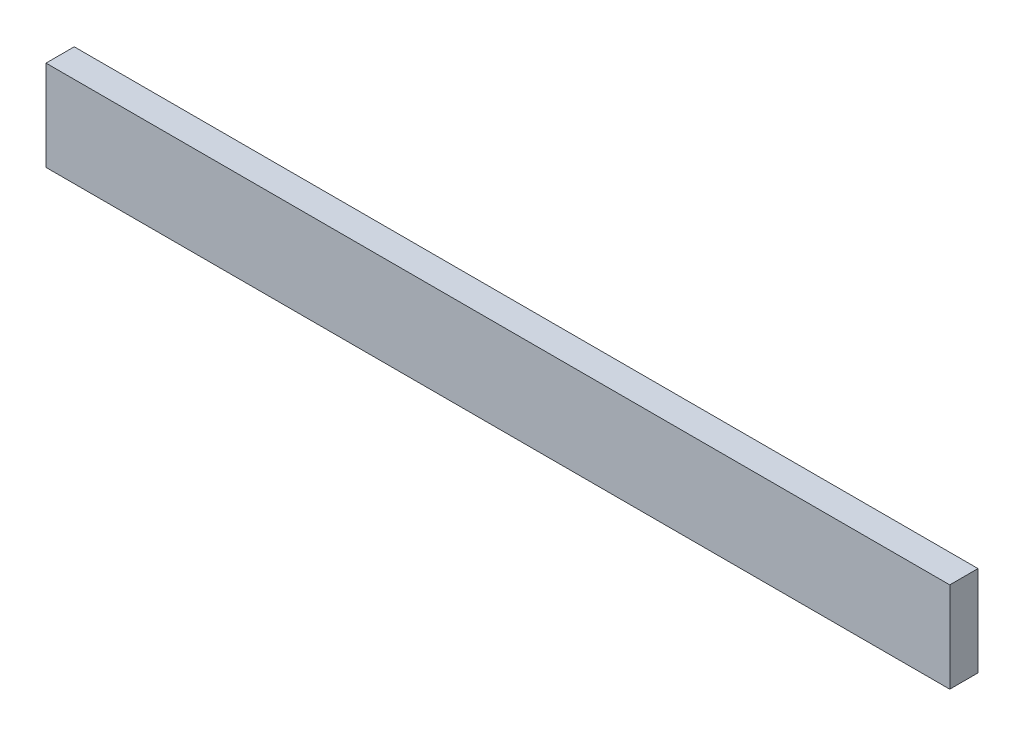
ISO-10303-21;
HEADER;
FILE_DESCRIPTION(('STEP AP214'),'2;1');
FILE_NAME('part.step','',(''),(''),'','','');
FILE_SCHEMA(('AUTOMOTIVE_DESIGN { 1 0 10303 214 1 1 1 1 }'));
ENDSEC;
DATA;
#1=APPLICATION_CONTEXT('core data for automotive mechanical design processes');
#2=APPLICATION_PROTOCOL_DEFINITION('international standard','automotive_design',2000,#1);
#3=PRODUCT_CONTEXT('',#1,'mechanical');
#4=PRODUCT('Part','Part','',(#3));
#5=PRODUCT_RELATED_PRODUCT_CATEGORY('part','',(#4));
#6=PRODUCT_DEFINITION_FORMATION('','',#4);
#7=PRODUCT_DEFINITION_CONTEXT('part definition',#1,'design');
#8=PRODUCT_DEFINITION('design','',#6,#7);
#9=PRODUCT_DEFINITION_SHAPE('','',#8);
#10=(LENGTH_UNIT() NAMED_UNIT(*) SI_UNIT(.MILLI.,.METRE.));
#11=(NAMED_UNIT(*) PLANE_ANGLE_UNIT() SI_UNIT($,.RADIAN.));
#12=(NAMED_UNIT(*) SI_UNIT($,.STERADIAN.) SOLID_ANGLE_UNIT());
#13=UNCERTAINTY_MEASURE_WITH_UNIT(LENGTH_MEASURE(1.E-05),#10,'distance_accuracy_value','');
#14=(GEOMETRIC_REPRESENTATION_CONTEXT(3) GLOBAL_UNCERTAINTY_ASSIGNED_CONTEXT((#13)) GLOBAL_UNIT_ASSIGNED_CONTEXT((#10,
#11,#12)) REPRESENTATION_CONTEXT('',''));
#15=CARTESIAN_POINT('',(0.,0.,0.));
#16=DIRECTION('',(0.,0.,1.));
#17=DIRECTION('',(1.,0.,0.));
#18=AXIS2_PLACEMENT_3D('',#15,#16,#17);
#19=CARTESIAN_POINT('',(0.,0.,25.));
#20=DIRECTION('',(1.,0.,0.));
#21=DIRECTION('',(0.,0.,-1.));
#22=AXIS2_PLACEMENT_3D('',#19,#20,#21);
#23=PLANE('',#22);
#24=DIRECTION('',(0.,-1.,0.));
#25=VECTOR('',#24,1.);
#26=CARTESIAN_POINT('',(0.,0.,0.));
#27=LINE('',#26,#25);
#28=CARTESIAN_POINT('',(0.,80.,0.));
#29=VERTEX_POINT('',#28);
#30=CARTESIAN_POINT('',(0.,0.,0.));
#31=VERTEX_POINT('',#30);
#32=EDGE_CURVE('E111',#29,#31,#27,.T.);
#33=ORIENTED_EDGE('',*,*,#32,.T.);
#34=DIRECTION('',(0.,0.,-1.));
#35=VECTOR('',#34,1.);
#36=CARTESIAN_POINT('',(0.,0.,25.));
#37=LINE('',#36,#35);
#38=CARTESIAN_POINT('',(0.,0.,25.));
#39=VERTEX_POINT('',#38);
#40=EDGE_CURVE('E11',#39,#31,#37,.T.);
#41=ORIENTED_EDGE('',*,*,#40,.F.);
#42=DIRECTION('',(0.,-1.,0.));
#43=VECTOR('',#42,1.);
#44=CARTESIAN_POINT('',(0.,0.,25.));
#45=LINE('',#44,#43);
#46=CARTESIAN_POINT('',(0.,80.,25.));
#47=VERTEX_POINT('',#46);
#48=EDGE_CURVE('E95',#47,#39,#45,.T.);
#49=ORIENTED_EDGE('',*,*,#48,.F.);
#50=DIRECTION('',(0.,0.,-1.));
#51=VECTOR('',#50,1.);
#52=CARTESIAN_POINT('',(0.,80.,25.));
#53=LINE('',#52,#51);
#54=EDGE_CURVE('E107',#47,#29,#53,.T.);
#55=ORIENTED_EDGE('',*,*,#54,.T.);
#56=EDGE_LOOP('',(#33,#41,#49,#55));
#57=FACE_BOUND('',#56,.T.);
#58=ADVANCED_FACE('F43',(#57),#23,.F.);
#59=CARTESIAN_POINT('',(0.,0.,25.));
#60=DIRECTION('',(0.,1.,0.));
#61=DIRECTION('',(0.,0.,1.));
#62=AXIS2_PLACEMENT_3D('',#59,#60,#61);
#63=PLANE('',#62);
#64=DIRECTION('',(1.,0.,0.));
#65=VECTOR('',#64,1.);
#66=CARTESIAN_POINT('',(0.,0.,0.));
#67=LINE('',#66,#65);
#68=CARTESIAN_POINT('',(800.,0.,0.));
#69=VERTEX_POINT('',#68);
#70=EDGE_CURVE('E100',#31,#69,#67,.T.);
#71=ORIENTED_EDGE('',*,*,#70,.T.);
#72=DIRECTION('',(0.,0.,-1.));
#73=VECTOR('',#72,1.);
#74=CARTESIAN_POINT('',(800.,0.,25.));
#75=LINE('',#74,#73);
#76=CARTESIAN_POINT('',(800.,0.,25.));
#77=VERTEX_POINT('',#76);
#78=EDGE_CURVE('E52',#77,#69,#75,.T.);
#79=ORIENTED_EDGE('',*,*,#78,.F.);
#80=DIRECTION('',(1.,0.,0.));
#81=VECTOR('',#80,1.);
#82=CARTESIAN_POINT('',(0.,0.,25.));
#83=LINE('',#82,#81);
#84=EDGE_CURVE('E90',#39,#77,#83,.T.);
#85=ORIENTED_EDGE('',*,*,#84,.F.);
#86=ORIENTED_EDGE('',*,*,#40,.T.);
#87=EDGE_LOOP('',(#71,#79,#85,#86));
#88=FACE_BOUND('',#87,.T.);
#89=ADVANCED_FACE('F99',(#88),#63,.F.);
#90=CARTESIAN_POINT('',(800.,0.,25.));
#91=DIRECTION('',(-1.,0.,0.));
#92=DIRECTION('',(0.,0.,1.));
#93=AXIS2_PLACEMENT_3D('',#90,#91,#92);
#94=PLANE('',#93);
#95=DIRECTION('',(0.,1.,0.));
#96=VECTOR('',#95,1.);
#97=CARTESIAN_POINT('',(800.,0.,0.));
#98=LINE('',#97,#96);
#99=CARTESIAN_POINT('',(800.,80.,0.));
#100=VERTEX_POINT('',#99);
#101=EDGE_CURVE('E77',#69,#100,#98,.T.);
#102=ORIENTED_EDGE('',*,*,#101,.T.);
#103=DIRECTION('',(0.,0.,-1.));
#104=VECTOR('',#103,1.);
#105=CARTESIAN_POINT('',(800.,80.,25.));
#106=LINE('',#105,#104);
#107=CARTESIAN_POINT('',(800.,80.,25.));
#108=VERTEX_POINT('',#107);
#109=EDGE_CURVE('E102',#108,#100,#106,.T.);
#110=ORIENTED_EDGE('',*,*,#109,.F.);
#111=DIRECTION('',(0.,1.,0.));
#112=VECTOR('',#111,1.);
#113=CARTESIAN_POINT('',(800.,0.,25.));
#114=LINE('',#113,#112);
#115=EDGE_CURVE('E93',#77,#108,#114,.T.);
#116=ORIENTED_EDGE('',*,*,#115,.F.);
#117=ORIENTED_EDGE('',*,*,#78,.T.);
#118=EDGE_LOOP('',(#102,#110,#116,#117));
#119=FACE_BOUND('',#118,.T.);
#120=ADVANCED_FACE('F103',(#119),#94,.F.);
#121=CARTESIAN_POINT('',(0.,80.,25.));
#122=DIRECTION('',(0.,-1.,0.));
#123=DIRECTION('',(0.,0.,-1.));
#124=AXIS2_PLACEMENT_3D('',#121,#122,#123);
#125=PLANE('',#124);
#126=DIRECTION('',(-1.,0.,0.));
#127=VECTOR('',#126,1.);
#128=CARTESIAN_POINT('',(0.,80.,0.));
#129=LINE('',#128,#127);
#130=EDGE_CURVE('E83',#100,#29,#129,.T.);
#131=ORIENTED_EDGE('',*,*,#130,.T.);
#132=ORIENTED_EDGE('',*,*,#54,.F.);
#133=DIRECTION('',(-1.,0.,0.));
#134=VECTOR('',#133,1.);
#135=CARTESIAN_POINT('',(0.,80.,25.));
#136=LINE('',#135,#134);
#137=EDGE_CURVE('E60',#108,#47,#136,.T.);
#138=ORIENTED_EDGE('',*,*,#137,.F.);
#139=ORIENTED_EDGE('',*,*,#109,.T.);
#140=EDGE_LOOP('',(#131,#132,#138,#139));
#141=FACE_BOUND('',#140,.T.);
#142=ADVANCED_FACE('F124',(#141),#125,.F.);
#143=CARTESIAN_POINT('',(0.,0.,25.));
#144=DIRECTION('',(0.,0.,-1.));
#145=DIRECTION('',(-1.,0.,0.));
#146=AXIS2_PLACEMENT_3D('',#143,#144,#145);
#147=PLANE('',#146);
#148=ORIENTED_EDGE('',*,*,#48,.T.);
#149=ORIENTED_EDGE('',*,*,#84,.T.);
#150=ORIENTED_EDGE('',*,*,#115,.T.);
#151=ORIENTED_EDGE('',*,*,#137,.T.);
#152=EDGE_LOOP('',(#148,#149,#150,#151));
#153=FACE_BOUND('',#152,.T.);
#154=ADVANCED_FACE('F91',(#153),#147,.F.);
#155=CARTESIAN_POINT('',(0.,0.,0.));
#156=DIRECTION('',(0.,0.,-1.));
#157=DIRECTION('',(-1.,0.,0.));
#158=AXIS2_PLACEMENT_3D('',#155,#156,#157);
#159=PLANE('',#158);
#160=ORIENTED_EDGE('',*,*,#32,.F.);
#161=ORIENTED_EDGE('',*,*,#130,.F.);
#162=ORIENTED_EDGE('',*,*,#101,.F.);
#163=ORIENTED_EDGE('',*,*,#70,.F.);
#164=EDGE_LOOP('',(#160,#161,#162,#163));
#165=FACE_BOUND('',#164,.T.);
#166=ADVANCED_FACE('F127',(#165),#159,.T.);
#167=CLOSED_SHELL('',(#58,#89,#120,#142,#154,#166));
#168=MANIFOLD_SOLID_BREP('B2',#167);
#169=ADVANCED_BREP_SHAPE_REPRESENTATION('',(#18,#168),#14);
#170=SHAPE_DEFINITION_REPRESENTATION(#9,#169);
ENDSEC;
END-ISO-10303-21;
